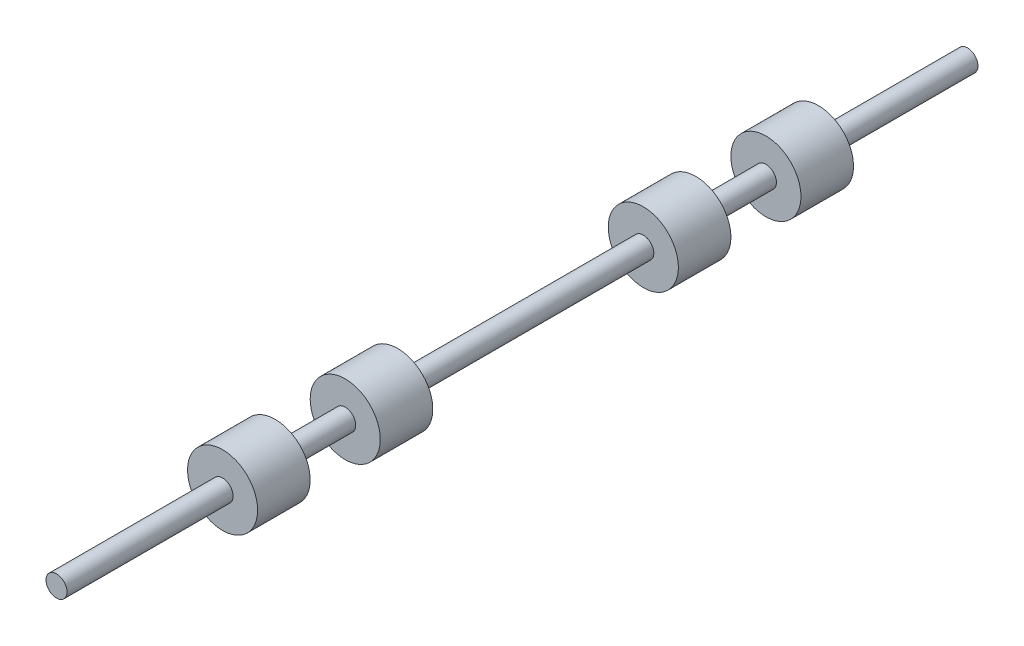
ISO-10303-21;
HEADER;
FILE_DESCRIPTION(('STEP AP214'),'2;1');
FILE_NAME('part.step','',(''),(''),'','','');
FILE_SCHEMA(('AUTOMOTIVE_DESIGN { 1 0 10303 214 1 1 1 1 }'));
ENDSEC;
DATA;
#1=APPLICATION_CONTEXT('core data for automotive mechanical design processes');
#2=APPLICATION_PROTOCOL_DEFINITION('international standard','automotive_design',2000,#1);
#3=PRODUCT_CONTEXT('',#1,'mechanical');
#4=PRODUCT('Part','Part','',(#3));
#5=PRODUCT_RELATED_PRODUCT_CATEGORY('part','',(#4));
#6=PRODUCT_DEFINITION_FORMATION('','',#4);
#7=PRODUCT_DEFINITION_CONTEXT('part definition',#1,'design');
#8=PRODUCT_DEFINITION('design','',#6,#7);
#9=PRODUCT_DEFINITION_SHAPE('','',#8);
#10=(LENGTH_UNIT() NAMED_UNIT(*) SI_UNIT(.MILLI.,.METRE.));
#11=(NAMED_UNIT(*) PLANE_ANGLE_UNIT() SI_UNIT($,.RADIAN.));
#12=(NAMED_UNIT(*) SI_UNIT($,.STERADIAN.) SOLID_ANGLE_UNIT());
#13=UNCERTAINTY_MEASURE_WITH_UNIT(LENGTH_MEASURE(1.E-05),#10,'distance_accuracy_value','');
#14=(GEOMETRIC_REPRESENTATION_CONTEXT(3) GLOBAL_UNCERTAINTY_ASSIGNED_CONTEXT((#13)) GLOBAL_UNIT_ASSIGNED_CONTEXT((#10,
#11,#12)) REPRESENTATION_CONTEXT('',''));
#15=CARTESIAN_POINT('',(0.,0.,0.));
#16=DIRECTION('',(0.,0.,1.));
#17=DIRECTION('',(1.,0.,0.));
#18=AXIS2_PLACEMENT_3D('',#15,#16,#17);
#19=CARTESIAN_POINT('',(0.,0.,26.));
#20=DIRECTION('',(0.,0.,-1.));
#21=DIRECTION('',(-1.,0.,0.));
#22=AXIS2_PLACEMENT_3D('',#19,#20,#21);
#23=CYLINDRICAL_SURFACE('',#22,0.3);
#24=CARTESIAN_POINT('',(0.,0.,17.76));
#25=DIRECTION('',(0.,0.,-1.));
#26=DIRECTION('',(-1.,0.,0.));
#27=AXIS2_PLACEMENT_3D('',#24,#25,#26);
#28=CIRCLE('',#27,0.3);
#29=CARTESIAN_POINT('',(-0.3,0.,17.76));
#30=VERTEX_POINT('',#29);
#31=EDGE_CURVE('E42',#30,#30,#28,.T.);
#32=ORIENTED_EDGE('',*,*,#31,.F.);
#33=EDGE_LOOP('',(#32));
#34=FACE_BOUND('',#33,.T.);
#35=CARTESIAN_POINT('',(0.,0.,19.76));
#36=DIRECTION('',(0.,0.,1.));
#37=DIRECTION('',(1.,0.,0.));
#38=AXIS2_PLACEMENT_3D('',#35,#36,#37);
#39=CIRCLE('',#38,0.3);
#40=CARTESIAN_POINT('',(0.3,0.,19.76));
#41=VERTEX_POINT('',#40);
#42=EDGE_CURVE('E38',#41,#41,#39,.T.);
#43=ORIENTED_EDGE('',*,*,#42,.F.);
#44=EDGE_LOOP('',(#43));
#45=FACE_BOUND('',#44,.T.);
#46=ADVANCED_FACE('F31',(#34,#45),#23,.T.);
#47=CARTESIAN_POINT('',(0.,0.,9.253));
#48=DIRECTION('',(0.,0.,-1.));
#49=DIRECTION('',(-1.,0.,0.));
#50=AXIS2_PLACEMENT_3D('',#47,#48,#49);
#51=CIRCLE('',#50,0.3);
#52=CARTESIAN_POINT('',(-0.3,0.,9.253));
#53=VERTEX_POINT('',#52);
#54=EDGE_CURVE('E51',#53,#53,#51,.T.);
#55=ORIENTED_EDGE('',*,*,#54,.F.);
#56=EDGE_LOOP('',(#55));
#57=FACE_BOUND('',#56,.T.);
#58=CARTESIAN_POINT('',(0.,0.,16.26));
#59=DIRECTION('',(0.,0.,1.));
#60=DIRECTION('',(1.,0.,0.));
#61=AXIS2_PLACEMENT_3D('',#58,#59,#60);
#62=CIRCLE('',#61,0.3);
#63=CARTESIAN_POINT('',(0.3,0.,16.26));
#64=VERTEX_POINT('',#63);
#65=EDGE_CURVE('E46',#64,#64,#62,.T.);
#66=ORIENTED_EDGE('',*,*,#65,.F.);
#67=EDGE_LOOP('',(#66));
#68=FACE_BOUND('',#67,.T.);
#69=ADVANCED_FACE('F113',(#57,#68),#23,.T.);
#70=CARTESIAN_POINT('',(0.,0.,5.753));
#71=DIRECTION('',(0.,0.,-1.));
#72=DIRECTION('',(-1.,0.,0.));
#73=AXIS2_PLACEMENT_3D('',#70,#71,#72);
#74=CIRCLE('',#73,0.3);
#75=CARTESIAN_POINT('',(-0.3,0.,5.753));
#76=VERTEX_POINT('',#75);
#77=EDGE_CURVE('E57',#76,#76,#74,.T.);
#78=ORIENTED_EDGE('',*,*,#77,.F.);
#79=EDGE_LOOP('',(#78));
#80=FACE_BOUND('',#79,.T.);
#81=CARTESIAN_POINT('',(0.,0.,7.753));
#82=DIRECTION('',(0.,0.,1.));
#83=DIRECTION('',(1.,0.,0.));
#84=AXIS2_PLACEMENT_3D('',#81,#82,#83);
#85=CIRCLE('',#84,0.3);
#86=CARTESIAN_POINT('',(0.3,0.,7.753));
#87=VERTEX_POINT('',#86);
#88=EDGE_CURVE('E54',#87,#87,#85,.T.);
#89=ORIENTED_EDGE('',*,*,#88,.F.);
#90=EDGE_LOOP('',(#89));
#91=FACE_BOUND('',#90,.T.);
#92=ADVANCED_FACE('F118',(#80,#91),#23,.T.);
#93=CARTESIAN_POINT('',(0.,0.,5.753));
#94=DIRECTION('',(0.,0.,-1.));
#95=DIRECTION('',(-1.,0.,0.));
#96=AXIS2_PLACEMENT_3D('',#93,#94,#95);
#97=PLANE('',#96);
#98=ORIENTED_EDGE('',*,*,#77,.T.);
#99=EDGE_LOOP('',(#98));
#100=FACE_BOUND('',#99,.T.);
#101=CARTESIAN_POINT('',(0.,0.,5.753));
#102=DIRECTION('',(0.,0.,-1.));
#103=DIRECTION('',(-1.,0.,0.));
#104=AXIS2_PLACEMENT_3D('',#101,#102,#103);
#105=CIRCLE('',#104,1.);
#106=CARTESIAN_POINT('',(-1.,0.,5.753));
#107=VERTEX_POINT('',#106);
#108=EDGE_CURVE('E67',#107,#107,#105,.T.);
#109=ORIENTED_EDGE('',*,*,#108,.F.);
#110=EDGE_LOOP('',(#109));
#111=FACE_BOUND('',#110,.T.);
#112=ADVANCED_FACE('F148',(#100,#111),#97,.F.);
#113=CARTESIAN_POINT('',(0.,0.,0.));
#114=DIRECTION('',(0.,0.,-1.));
#115=DIRECTION('',(-1.,0.,0.));
#116=AXIS2_PLACEMENT_3D('',#113,#114,#115);
#117=CYLINDRICAL_SURFACE('',#116,1.);
#118=CARTESIAN_POINT('',(0.,0.,4.253));
#119=DIRECTION('',(0.,0.,-1.));
#120=DIRECTION('',(-1.,0.,0.));
#121=AXIS2_PLACEMENT_3D('',#118,#119,#120);
#122=CIRCLE('',#121,1.);
#123=CARTESIAN_POINT('',(-1.,0.,4.253));
#124=VERTEX_POINT('',#123);
#125=EDGE_CURVE('E72',#124,#124,#122,.T.);
#126=ORIENTED_EDGE('',*,*,#125,.F.);
#127=EDGE_LOOP('',(#126));
#128=FACE_BOUND('',#127,.T.);
#129=ORIENTED_EDGE('',*,*,#108,.T.);
#130=EDGE_LOOP('',(#129));
#131=FACE_BOUND('',#130,.T.);
#132=ADVANCED_FACE('F153',(#128,#131),#117,.T.);
#133=CARTESIAN_POINT('',(0.,0.,4.253));
#134=DIRECTION('',(0.,0.,1.));
#135=DIRECTION('',(1.,0.,0.));
#136=AXIS2_PLACEMENT_3D('',#133,#134,#135);
#137=PLANE('',#136);
#138=CARTESIAN_POINT('',(0.,0.,4.253));
#139=DIRECTION('',(0.,0.,1.));
#140=DIRECTION('',(1.,0.,0.));
#141=AXIS2_PLACEMENT_3D('',#138,#139,#140);
#142=CIRCLE('',#141,0.3);
#143=CARTESIAN_POINT('',(0.3,0.,4.253));
#144=VERTEX_POINT('',#143);
#145=EDGE_CURVE('E60',#144,#144,#142,.T.);
#146=ORIENTED_EDGE('',*,*,#145,.T.);
#147=EDGE_LOOP('',(#146));
#148=FACE_BOUND('',#147,.T.);
#149=ORIENTED_EDGE('',*,*,#125,.T.);
#150=EDGE_LOOP('',(#149));
#151=FACE_BOUND('',#150,.T.);
#152=ADVANCED_FACE('F144',(#148,#151),#137,.F.);
#153=CARTESIAN_POINT('',(0.,0.,0.));
#154=DIRECTION('',(0.,0.,1.));
#155=DIRECTION('',(1.,0.,0.));
#156=AXIS2_PLACEMENT_3D('',#153,#154,#155);
#157=PLANE('',#156);
#158=CARTESIAN_POINT('',(0.,0.,0.));
#159=DIRECTION('',(0.,0.,1.));
#160=DIRECTION('',(1.,0.,0.));
#161=AXIS2_PLACEMENT_3D('',#158,#159,#160);
#162=CIRCLE('',#161,0.3);
#163=CARTESIAN_POINT('',(0.3,0.,0.));
#164=VERTEX_POINT('',#163);
#165=EDGE_CURVE('E64',#164,#164,#162,.T.);
#166=ORIENTED_EDGE('',*,*,#165,.F.);
#167=EDGE_LOOP('',(#166));
#168=FACE_BOUND('',#167,.T.);
#169=ADVANCED_FACE('F135',(#168),#157,.F.);
#170=ORIENTED_EDGE('',*,*,#165,.T.);
#171=EDGE_LOOP('',(#170));
#172=FACE_BOUND('',#171,.T.);
#173=ORIENTED_EDGE('',*,*,#145,.F.);
#174=EDGE_LOOP('',(#173));
#175=FACE_BOUND('',#174,.T.);
#176=ADVANCED_FACE('F125',(#172,#175),#23,.T.);
#177=CARTESIAN_POINT('',(0.,0.,9.253));
#178=DIRECTION('',(0.,0.,-1.));
#179=DIRECTION('',(-1.,0.,0.));
#180=AXIS2_PLACEMENT_3D('',#177,#178,#179);
#181=PLANE('',#180);
#182=ORIENTED_EDGE('',*,*,#54,.T.);
#183=EDGE_LOOP('',(#182));
#184=FACE_BOUND('',#183,.T.);
#185=CARTESIAN_POINT('',(0.,0.,9.253));
#186=DIRECTION('',(0.,0.,-1.));
#187=DIRECTION('',(-1.,0.,0.));
#188=AXIS2_PLACEMENT_3D('',#185,#186,#187);
#189=CIRCLE('',#188,1.);
#190=CARTESIAN_POINT('',(-1.,0.,9.253));
#191=VERTEX_POINT('',#190);
#192=EDGE_CURVE('E75',#191,#191,#189,.T.);
#193=ORIENTED_EDGE('',*,*,#192,.F.);
#194=EDGE_LOOP('',(#193));
#195=FACE_BOUND('',#194,.T.);
#196=ADVANCED_FACE('F134',(#184,#195),#181,.F.);
#197=CARTESIAN_POINT('',(0.,0.,0.));
#198=DIRECTION('',(0.,0.,-1.));
#199=DIRECTION('',(-1.,0.,0.));
#200=AXIS2_PLACEMENT_3D('',#197,#198,#199);
#201=CYLINDRICAL_SURFACE('',#200,1.);
#202=CARTESIAN_POINT('',(0.,0.,7.753));
#203=DIRECTION('',(0.,0.,-1.));
#204=DIRECTION('',(-1.,0.,0.));
#205=AXIS2_PLACEMENT_3D('',#202,#203,#204);
#206=CIRCLE('',#205,1.);
#207=CARTESIAN_POINT('',(-1.,0.,7.753));
#208=VERTEX_POINT('',#207);
#209=EDGE_CURVE('E78',#208,#208,#206,.T.);
#210=ORIENTED_EDGE('',*,*,#209,.F.);
#211=EDGE_LOOP('',(#210));
#212=FACE_BOUND('',#211,.T.);
#213=ORIENTED_EDGE('',*,*,#192,.T.);
#214=EDGE_LOOP('',(#213));
#215=FACE_BOUND('',#214,.T.);
#216=ADVANCED_FACE('F141',(#212,#215),#201,.T.);
#217=CARTESIAN_POINT('',(0.,0.,7.753));
#218=DIRECTION('',(0.,0.,1.));
#219=DIRECTION('',(1.,0.,0.));
#220=AXIS2_PLACEMENT_3D('',#217,#218,#219);
#221=PLANE('',#220);
#222=ORIENTED_EDGE('',*,*,#88,.T.);
#223=EDGE_LOOP('',(#222));
#224=FACE_BOUND('',#223,.T.);
#225=ORIENTED_EDGE('',*,*,#209,.T.);
#226=EDGE_LOOP('',(#225));
#227=FACE_BOUND('',#226,.T.);
#228=ADVANCED_FACE('F160',(#224,#227),#221,.F.);
#229=CARTESIAN_POINT('',(0.,0.,17.76));
#230=DIRECTION('',(0.,0.,-1.));
#231=DIRECTION('',(-1.,0.,0.));
#232=AXIS2_PLACEMENT_3D('',#229,#230,#231);
#233=PLANE('',#232);
#234=ORIENTED_EDGE('',*,*,#31,.T.);
#235=EDGE_LOOP('',(#234));
#236=FACE_BOUND('',#235,.T.);
#237=CARTESIAN_POINT('',(0.,0.,17.76));
#238=DIRECTION('',(0.,0.,-1.));
#239=DIRECTION('',(-1.,0.,0.));
#240=AXIS2_PLACEMENT_3D('',#237,#238,#239);
#241=CIRCLE('',#240,1.);
#242=CARTESIAN_POINT('',(-1.,0.,17.76));
#243=VERTEX_POINT('',#242);
#244=EDGE_CURVE('E81',#243,#243,#241,.T.);
#245=ORIENTED_EDGE('',*,*,#244,.F.);
#246=EDGE_LOOP('',(#245));
#247=FACE_BOUND('',#246,.T.);
#248=ADVANCED_FACE('F163',(#236,#247),#233,.F.);
#249=CARTESIAN_POINT('',(0.,0.,0.));
#250=DIRECTION('',(0.,0.,-1.));
#251=DIRECTION('',(-1.,0.,0.));
#252=AXIS2_PLACEMENT_3D('',#249,#250,#251);
#253=CYLINDRICAL_SURFACE('',#252,1.);
#254=CARTESIAN_POINT('',(0.,0.,16.26));
#255=DIRECTION('',(0.,0.,-1.));
#256=DIRECTION('',(-1.,0.,0.));
#257=AXIS2_PLACEMENT_3D('',#254,#255,#256);
#258=CIRCLE('',#257,1.);
#259=CARTESIAN_POINT('',(-1.,0.,16.26));
#260=VERTEX_POINT('',#259);
#261=EDGE_CURVE('E84',#260,#260,#258,.T.);
#262=ORIENTED_EDGE('',*,*,#261,.F.);
#263=EDGE_LOOP('',(#262));
#264=FACE_BOUND('',#263,.T.);
#265=ORIENTED_EDGE('',*,*,#244,.T.);
#266=EDGE_LOOP('',(#265));
#267=FACE_BOUND('',#266,.T.);
#268=ADVANCED_FACE('F109',(#264,#267),#253,.T.);
#269=CARTESIAN_POINT('',(0.,0.,16.26));
#270=DIRECTION('',(0.,0.,1.));
#271=DIRECTION('',(1.,0.,0.));
#272=AXIS2_PLACEMENT_3D('',#269,#270,#271);
#273=PLANE('',#272);
#274=ORIENTED_EDGE('',*,*,#65,.T.);
#275=EDGE_LOOP('',(#274));
#276=FACE_BOUND('',#275,.T.);
#277=ORIENTED_EDGE('',*,*,#261,.T.);
#278=EDGE_LOOP('',(#277));
#279=FACE_BOUND('',#278,.T.);
#280=ADVANCED_FACE('F104',(#276,#279),#273,.F.);
#281=CARTESIAN_POINT('',(0.,0.,21.26));
#282=DIRECTION('',(0.,0.,-1.));
#283=DIRECTION('',(-1.,0.,0.));
#284=AXIS2_PLACEMENT_3D('',#281,#282,#283);
#285=PLANE('',#284);
#286=CARTESIAN_POINT('',(0.,0.,21.26));
#287=DIRECTION('',(0.,0.,-1.));
#288=DIRECTION('',(-1.,0.,0.));
#289=AXIS2_PLACEMENT_3D('',#286,#287,#288);
#290=CIRCLE('',#289,0.3);
#291=CARTESIAN_POINT('',(-0.3,0.,21.26));
#292=VERTEX_POINT('',#291);
#293=EDGE_CURVE('E10',#292,#292,#290,.T.);
#294=ORIENTED_EDGE('',*,*,#293,.T.);
#295=EDGE_LOOP('',(#294));
#296=FACE_BOUND('',#295,.T.);
#297=CARTESIAN_POINT('',(0.,0.,21.26));
#298=DIRECTION('',(0.,0.,-1.));
#299=DIRECTION('',(-1.,0.,0.));
#300=AXIS2_PLACEMENT_3D('',#297,#298,#299);
#301=CIRCLE('',#300,1.);
#302=CARTESIAN_POINT('',(-1.,0.,21.26));
#303=VERTEX_POINT('',#302);
#304=EDGE_CURVE('E87',#303,#303,#301,.T.);
#305=ORIENTED_EDGE('',*,*,#304,.F.);
#306=EDGE_LOOP('',(#305));
#307=FACE_BOUND('',#306,.T.);
#308=ADVANCED_FACE('F99',(#296,#307),#285,.F.);
#309=CARTESIAN_POINT('',(0.,0.,0.));
#310=DIRECTION('',(0.,0.,-1.));
#311=DIRECTION('',(-1.,0.,0.));
#312=AXIS2_PLACEMENT_3D('',#309,#310,#311);
#313=CYLINDRICAL_SURFACE('',#312,1.);
#314=CARTESIAN_POINT('',(0.,0.,19.76));
#315=DIRECTION('',(0.,0.,-1.));
#316=DIRECTION('',(-1.,0.,0.));
#317=AXIS2_PLACEMENT_3D('',#314,#315,#316);
#318=CIRCLE('',#317,1.);
#319=CARTESIAN_POINT('',(-1.,0.,19.76));
#320=VERTEX_POINT('',#319);
#321=EDGE_CURVE('E90',#320,#320,#318,.T.);
#322=ORIENTED_EDGE('',*,*,#321,.F.);
#323=EDGE_LOOP('',(#322));
#324=FACE_BOUND('',#323,.T.);
#325=ORIENTED_EDGE('',*,*,#304,.T.);
#326=EDGE_LOOP('',(#325));
#327=FACE_BOUND('',#326,.T.);
#328=ADVANCED_FACE('F96',(#324,#327),#313,.T.);
#329=CARTESIAN_POINT('',(0.,0.,19.76));
#330=DIRECTION('',(0.,0.,1.));
#331=DIRECTION('',(1.,0.,0.));
#332=AXIS2_PLACEMENT_3D('',#329,#330,#331);
#333=PLANE('',#332);
#334=ORIENTED_EDGE('',*,*,#42,.T.);
#335=EDGE_LOOP('',(#334));
#336=FACE_BOUND('',#335,.T.);
#337=ORIENTED_EDGE('',*,*,#321,.T.);
#338=EDGE_LOOP('',(#337));
#339=FACE_BOUND('',#338,.T.);
#340=ADVANCED_FACE('F94',(#336,#339),#333,.F.);
#341=CARTESIAN_POINT('',(0.,0.,26.));
#342=DIRECTION('',(0.,0.,1.));
#343=DIRECTION('',(1.,0.,0.));
#344=AXIS2_PLACEMENT_3D('',#341,#342,#343);
#345=PLANE('',#344);
#346=CARTESIAN_POINT('',(0.,0.,26.));
#347=DIRECTION('',(0.,0.,1.));
#348=DIRECTION('',(1.,0.,0.));
#349=AXIS2_PLACEMENT_3D('',#346,#347,#348);
#350=CIRCLE('',#349,0.3);
#351=CARTESIAN_POINT('',(0.3,0.,26.));
#352=VERTEX_POINT('',#351);
#353=EDGE_CURVE('E63',#352,#352,#350,.T.);
#354=ORIENTED_EDGE('',*,*,#353,.T.);
#355=EDGE_LOOP('',(#354));
#356=FACE_BOUND('',#355,.T.);
#357=ADVANCED_FACE('F123',(#356),#345,.T.);
#358=ORIENTED_EDGE('',*,*,#353,.F.);
#359=EDGE_LOOP('',(#358));
#360=FACE_BOUND('',#359,.T.);
#361=ORIENTED_EDGE('',*,*,#293,.F.);
#362=EDGE_LOOP('',(#361));
#363=FACE_BOUND('',#362,.T.);
#364=ADVANCED_FACE('F33',(#360,#363),#23,.T.);
#365=CLOSED_SHELL('',(#46,#69,#92,#112,#132,#152,#169,#176,#196,#216,#228,#248,#268,#280,#308,
#328,#340,#357,#364));
#366=MANIFOLD_SOLID_BREP('B2',#365);
#367=ADVANCED_BREP_SHAPE_REPRESENTATION('',(#18,#366),#14);
#368=SHAPE_DEFINITION_REPRESENTATION(#9,#367);
ENDSEC;
END-ISO-10303-21;
